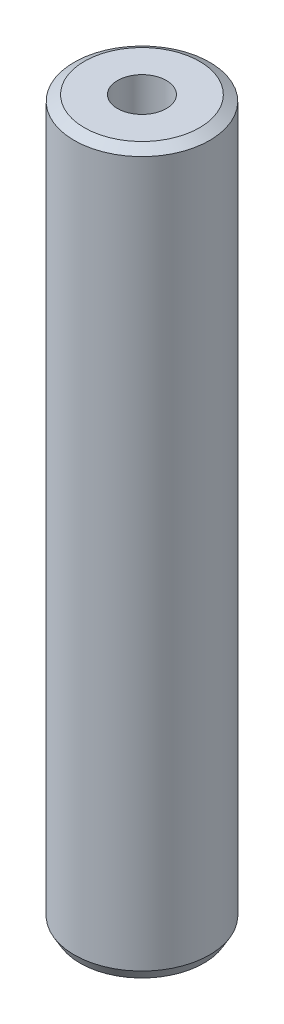
ISO-10303-21;
HEADER;
FILE_DESCRIPTION(('STEP AP214'),'2;1');
FILE_NAME('part.step','',(''),(''),'','','');
FILE_SCHEMA(('AUTOMOTIVE_DESIGN { 1 0 10303 214 1 1 1 1 }'));
ENDSEC;
DATA;
#1=APPLICATION_CONTEXT('core data for automotive mechanical design processes');
#2=APPLICATION_PROTOCOL_DEFINITION('international standard','automotive_design',2000,#1);
#3=PRODUCT_CONTEXT('',#1,'mechanical');
#4=PRODUCT('Part','Part','',(#3));
#5=PRODUCT_RELATED_PRODUCT_CATEGORY('part','',(#4));
#6=PRODUCT_DEFINITION_FORMATION('','',#4);
#7=PRODUCT_DEFINITION_CONTEXT('part definition',#1,'design');
#8=PRODUCT_DEFINITION('design','',#6,#7);
#9=PRODUCT_DEFINITION_SHAPE('','',#8);
#10=(LENGTH_UNIT() NAMED_UNIT(*) SI_UNIT(.MILLI.,.METRE.));
#11=(NAMED_UNIT(*) PLANE_ANGLE_UNIT() SI_UNIT($,.RADIAN.));
#12=(NAMED_UNIT(*) SI_UNIT($,.STERADIAN.) SOLID_ANGLE_UNIT());
#13=UNCERTAINTY_MEASURE_WITH_UNIT(LENGTH_MEASURE(1.E-05),#10,'distance_accuracy_value','');
#14=(GEOMETRIC_REPRESENTATION_CONTEXT(3) GLOBAL_UNCERTAINTY_ASSIGNED_CONTEXT((#13)) GLOBAL_UNIT_ASSIGNED_CONTEXT((#10,
#11,#12)) REPRESENTATION_CONTEXT('',''));
#15=CARTESIAN_POINT('',(0.,0.,0.));
#16=DIRECTION('',(0.,0.,1.));
#17=DIRECTION('',(1.,0.,0.));
#18=AXIS2_PLACEMENT_3D('',#15,#16,#17);
#19=CARTESIAN_POINT('',(0.,425.871727260582,0.));
#20=DIRECTION('',(0.,-1.,0.));
#21=DIRECTION('',(0.,0.,-1.));
#22=AXIS2_PLACEMENT_3D('',#19,#20,#21);
#23=CYLINDRICAL_SURFACE('',#22,40.);
#24=CARTESIAN_POINT('',(0.,422.40104238701,0.));
#25=DIRECTION('',(0.,1.,0.));
#26=DIRECTION('',(0.,0.,1.));
#27=AXIS2_PLACEMENT_3D('',#24,#25,#26);
#28=CIRCLE('',#27,40.);
#29=CARTESIAN_POINT('',(0.,422.40104238701,40.));
#30=VERTEX_POINT('',#29);
#31=EDGE_CURVE('E50',#30,#30,#28,.F.);
#32=ORIENTED_EDGE('',*,*,#31,.T.);
#33=EDGE_LOOP('',(#32));
#34=FACE_BOUND('',#33,.T.);
#35=CARTESIAN_POINT('',(0.,6.01140253808835,0.));
#36=DIRECTION('',(0.,1.,0.));
#37=DIRECTION('',(0.,0.,1.));
#38=AXIS2_PLACEMENT_3D('',#35,#36,#37);
#39=CIRCLE('',#38,40.);
#40=CARTESIAN_POINT('',(0.,6.01140253808835,40.));
#41=VERTEX_POINT('',#40);
#42=EDGE_CURVE('E51',#41,#41,#39,.T.);
#43=ORIENTED_EDGE('',*,*,#42,.T.);
#44=EDGE_LOOP('',(#43));
#45=FACE_BOUND('',#44,.T.);
#46=ADVANCED_FACE('F39',(#34,#45),#23,.T.);
#47=CARTESIAN_POINT('',(0.,425.871727260582,0.));
#48=DIRECTION('',(0.,1.,0.));
#49=DIRECTION('',(0.,0.,1.));
#50=AXIS2_PLACEMENT_3D('',#47,#48,#49);
#51=PLANE('',#50);
#52=CARTESIAN_POINT('',(0.,425.871727260582,0.));
#53=DIRECTION('',(0.,1.,0.));
#54=DIRECTION('',(0.,0.,1.));
#55=AXIS2_PLACEMENT_3D('',#52,#53,#54);
#56=CIRCLE('',#55,33.9885974619116);
#57=CARTESIAN_POINT('',(0.,425.871727260582,33.9885974619116));
#58=VERTEX_POINT('',#57);
#59=EDGE_CURVE('E54',#58,#58,#56,.T.);
#60=ORIENTED_EDGE('',*,*,#59,.T.);
#61=EDGE_LOOP('',(#60));
#62=FACE_BOUND('',#61,.T.);
#63=CARTESIAN_POINT('',(0.,425.871727260582,0.));
#64=DIRECTION('',(0.,1.,0.));
#65=DIRECTION('',(0.,0.,1.));
#66=AXIS2_PLACEMENT_3D('',#63,#64,#65);
#67=CIRCLE('',#66,14.4083309479211);
#68=CARTESIAN_POINT('',(0.,425.871727260582,14.4083309479211));
#69=VERTEX_POINT('',#68);
#70=EDGE_CURVE('E58',#69,#69,#67,.T.);
#71=ORIENTED_EDGE('',*,*,#70,.F.);
#72=EDGE_LOOP('',(#71));
#73=FACE_BOUND('',#72,.T.);
#74=ADVANCED_FACE('F69',(#62,#73),#51,.T.);
#75=CARTESIAN_POINT('',(0.,0.,0.));
#76=DIRECTION('',(0.,1.,0.));
#77=DIRECTION('',(0.,0.,1.));
#78=AXIS2_PLACEMENT_3D('',#75,#76,#77);
#79=PLANE('',#78);
#80=CARTESIAN_POINT('',(0.,0.,0.));
#81=DIRECTION('',(0.,1.,0.));
#82=DIRECTION('',(0.,0.,1.));
#83=AXIS2_PLACEMENT_3D('',#80,#81,#82);
#84=CIRCLE('',#83,36.5293151264274);
#85=CARTESIAN_POINT('',(0.,0.,36.5293151264274));
#86=VERTEX_POINT('',#85);
#87=EDGE_CURVE('E10',#86,#86,#84,.F.);
#88=ORIENTED_EDGE('',*,*,#87,.T.);
#89=EDGE_LOOP('',(#88));
#90=FACE_BOUND('',#89,.T.);
#91=CARTESIAN_POINT('',(0.,0.,0.));
#92=DIRECTION('',(0.,1.,0.));
#93=DIRECTION('',(0.,0.,1.));
#94=AXIS2_PLACEMENT_3D('',#91,#92,#93);
#95=CIRCLE('',#94,14.4083309479211);
#96=CARTESIAN_POINT('',(0.,0.,14.4083309479211));
#97=VERTEX_POINT('',#96);
#98=EDGE_CURVE('E63',#97,#97,#95,.T.);
#99=ORIENTED_EDGE('',*,*,#98,.T.);
#100=EDGE_LOOP('',(#99));
#101=FACE_BOUND('',#100,.T.);
#102=ADVANCED_FACE('F75',(#90,#101),#79,.F.);
#103=CARTESIAN_POINT('',(0.,425.871727260582,0.));
#104=DIRECTION('',(0.,-1.,0.));
#105=DIRECTION('',(0.,0.,-1.));
#106=AXIS2_PLACEMENT_3D('',#103,#104,#105);
#107=CYLINDRICAL_SURFACE('',#106,14.4083309479211);
#108=ORIENTED_EDGE('',*,*,#70,.T.);
#109=EDGE_LOOP('',(#108));
#110=FACE_BOUND('',#109,.T.);
#111=ORIENTED_EDGE('',*,*,#98,.F.);
#112=EDGE_LOOP('',(#111));
#113=FACE_BOUND('',#112,.T.);
#114=ADVANCED_FACE('F70',(#110,#113),#107,.F.);
#115=CARTESIAN_POINT('',(0.,425.871727260582,0.));
#116=DIRECTION('',(0.,-1.,0.));
#117=DIRECTION('',(0.,0.,-1.));
#118=AXIS2_PLACEMENT_3D('',#115,#116,#117);
#119=CONICAL_SURFACE('',#118,33.9885974619116,1.04719755119659);
#120=ORIENTED_EDGE('',*,*,#31,.F.);
#121=EDGE_LOOP('',(#120));
#122=FACE_BOUND('',#121,.T.);
#123=ORIENTED_EDGE('',*,*,#59,.F.);
#124=EDGE_LOOP('',(#123));
#125=FACE_BOUND('',#124,.T.);
#126=ADVANCED_FACE('F81',(#122,#125),#119,.T.);
#127=CARTESIAN_POINT('',(0.,6.01140253808835,0.));
#128=DIRECTION('',(0.,1.,0.));
#129=DIRECTION('',(0.,0.,1.));
#130=AXIS2_PLACEMENT_3D('',#127,#128,#129);
#131=CONICAL_SURFACE('',#130,40.,0.523598775598307);
#132=ORIENTED_EDGE('',*,*,#87,.F.);
#133=EDGE_LOOP('',(#132));
#134=FACE_BOUND('',#133,.T.);
#135=ORIENTED_EDGE('',*,*,#42,.F.);
#136=EDGE_LOOP('',(#135));
#137=FACE_BOUND('',#136,.T.);
#138=ADVANCED_FACE('F45',(#134,#137),#131,.T.);
#139=CLOSED_SHELL('',(#46,#74,#102,#114,#126,#138));
#140=MANIFOLD_SOLID_BREP('B2',#139);
#141=ADVANCED_BREP_SHAPE_REPRESENTATION('',(#18,#140),#14);
#142=SHAPE_DEFINITION_REPRESENTATION(#9,#141);
ENDSEC;
END-ISO-10303-21;
